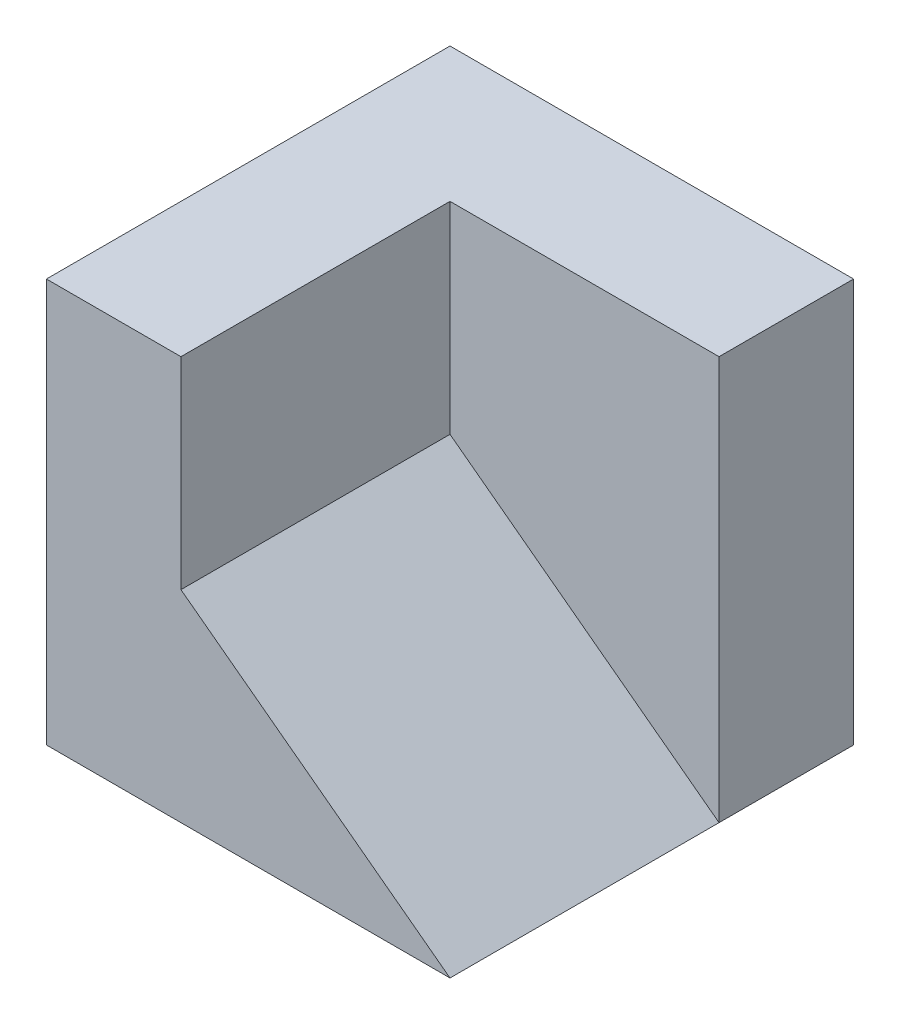
ISO-10303-21;
HEADER;
FILE_DESCRIPTION(('STEP AP214'),'2;1');
FILE_NAME('part.step','',(''),(''),'','','');
FILE_SCHEMA(('AUTOMOTIVE_DESIGN { 1 0 10303 214 1 1 1 1 }'));
ENDSEC;
DATA;
#1=APPLICATION_CONTEXT('core data for automotive mechanical design processes');
#2=APPLICATION_PROTOCOL_DEFINITION('international standard','automotive_design',2000,#1);
#3=PRODUCT_CONTEXT('',#1,'mechanical');
#4=PRODUCT('Part','Part','',(#3));
#5=PRODUCT_RELATED_PRODUCT_CATEGORY('part','',(#4));
#6=PRODUCT_DEFINITION_FORMATION('','',#4);
#7=PRODUCT_DEFINITION_CONTEXT('part definition',#1,'design');
#8=PRODUCT_DEFINITION('design','',#6,#7);
#9=PRODUCT_DEFINITION_SHAPE('','',#8);
#10=(LENGTH_UNIT() NAMED_UNIT(*) SI_UNIT(.MILLI.,.METRE.));
#11=(NAMED_UNIT(*) PLANE_ANGLE_UNIT() SI_UNIT($,.RADIAN.));
#12=(NAMED_UNIT(*) SI_UNIT($,.STERADIAN.) SOLID_ANGLE_UNIT());
#13=UNCERTAINTY_MEASURE_WITH_UNIT(LENGTH_MEASURE(1.E-05),#10,'distance_accuracy_value','');
#14=(GEOMETRIC_REPRESENTATION_CONTEXT(3) GLOBAL_UNCERTAINTY_ASSIGNED_CONTEXT((#13)) GLOBAL_UNIT_ASSIGNED_CONTEXT((#10,
#11,#12)) REPRESENTATION_CONTEXT('',''));
#15=CARTESIAN_POINT('',(0.,0.,0.));
#16=DIRECTION('',(0.,0.,1.));
#17=DIRECTION('',(1.,0.,0.));
#18=AXIS2_PLACEMENT_3D('',#15,#16,#17);
#19=CARTESIAN_POINT('',(60.,60.,0.));
#20=DIRECTION('',(-1.,0.,0.));
#21=DIRECTION('',(0.,0.,1.));
#22=AXIS2_PLACEMENT_3D('',#19,#20,#21);
#23=PLANE('',#22);
#24=DIRECTION('',(0.,1.,0.));
#25=VECTOR('',#24,1.);
#26=CARTESIAN_POINT('',(60.,60.,-40.));
#27=LINE('',#26,#25);
#28=CARTESIAN_POINT('',(60.,0.,-40.));
#29=VERTEX_POINT('',#28);
#30=CARTESIAN_POINT('',(60.,60.,-40.));
#31=VERTEX_POINT('',#30);
#32=EDGE_CURVE('E99',#29,#31,#27,.T.);
#33=ORIENTED_EDGE('',*,*,#32,.F.);
#34=DIRECTION('',(0.,0.,-1.));
#35=VECTOR('',#34,1.);
#36=CARTESIAN_POINT('',(60.,0.,0.));
#37=LINE('',#36,#35);
#38=CARTESIAN_POINT('',(60.,0.,-60.));
#39=VERTEX_POINT('',#38);
#40=EDGE_CURVE('E75',#29,#39,#37,.T.);
#41=ORIENTED_EDGE('',*,*,#40,.T.);
#42=DIRECTION('',(0.,-1.,0.));
#43=VECTOR('',#42,1.);
#44=CARTESIAN_POINT('',(60.,60.,-60.));
#45=LINE('',#44,#43);
#46=CARTESIAN_POINT('',(60.,60.,-60.));
#47=VERTEX_POINT('',#46);
#48=EDGE_CURVE('E112',#47,#39,#45,.T.);
#49=ORIENTED_EDGE('',*,*,#48,.F.);
#50=DIRECTION('',(0.,0.,-1.));
#51=VECTOR('',#50,1.);
#52=CARTESIAN_POINT('',(60.,60.,0.));
#53=LINE('',#52,#51);
#54=EDGE_CURVE('E50',#31,#47,#53,.T.);
#55=ORIENTED_EDGE('',*,*,#54,.F.);
#56=EDGE_LOOP('',(#33,#41,#49,#55));
#57=FACE_BOUND('',#56,.T.);
#58=ADVANCED_FACE('F33',(#57),#23,.F.);
#59=CARTESIAN_POINT('',(60.,60.,-60.));
#60=DIRECTION('',(0.,0.,1.));
#61=DIRECTION('',(1.,0.,0.));
#62=AXIS2_PLACEMENT_3D('',#59,#60,#61);
#63=PLANE('',#62);
#64=DIRECTION('',(-1.,0.,0.));
#65=VECTOR('',#64,1.);
#66=CARTESIAN_POINT('',(60.,0.,-60.));
#67=LINE('',#66,#65);
#68=CARTESIAN_POINT('',(0.,0.,-60.));
#69=VERTEX_POINT('',#68);
#70=EDGE_CURVE('E120',#39,#69,#67,.T.);
#71=ORIENTED_EDGE('',*,*,#70,.T.);
#72=DIRECTION('',(0.,-1.,0.));
#73=VECTOR('',#72,1.);
#74=CARTESIAN_POINT('',(0.,60.,-60.));
#75=LINE('',#74,#73);
#76=CARTESIAN_POINT('',(0.,60.,-60.));
#77=VERTEX_POINT('',#76);
#78=EDGE_CURVE('E11',#77,#69,#75,.T.);
#79=ORIENTED_EDGE('',*,*,#78,.F.);
#80=DIRECTION('',(-1.,0.,0.));
#81=VECTOR('',#80,1.);
#82=CARTESIAN_POINT('',(60.,60.,-60.));
#83=LINE('',#82,#81);
#84=EDGE_CURVE('E129',#47,#77,#83,.T.);
#85=ORIENTED_EDGE('',*,*,#84,.F.);
#86=ORIENTED_EDGE('',*,*,#48,.T.);
#87=EDGE_LOOP('',(#71,#79,#85,#86));
#88=FACE_BOUND('',#87,.T.);
#89=ADVANCED_FACE('F35',(#88),#63,.F.);
#90=CARTESIAN_POINT('',(0.,60.,-60.));
#91=DIRECTION('',(1.,0.,0.));
#92=DIRECTION('',(0.,0.,-1.));
#93=AXIS2_PLACEMENT_3D('',#90,#91,#92);
#94=PLANE('',#93);
#95=DIRECTION('',(0.,0.,1.));
#96=VECTOR('',#95,1.);
#97=CARTESIAN_POINT('',(0.,0.,-60.));
#98=LINE('',#97,#96);
#99=CARTESIAN_POINT('',(0.,0.,0.));
#100=VERTEX_POINT('',#99);
#101=EDGE_CURVE('E123',#69,#100,#98,.T.);
#102=ORIENTED_EDGE('',*,*,#101,.T.);
#103=DIRECTION('',(0.,-1.,0.));
#104=VECTOR('',#103,1.);
#105=CARTESIAN_POINT('',(0.,60.,0.));
#106=LINE('',#105,#104);
#107=CARTESIAN_POINT('',(0.,60.,0.));
#108=VERTEX_POINT('',#107);
#109=EDGE_CURVE('E42',#108,#100,#106,.T.);
#110=ORIENTED_EDGE('',*,*,#109,.F.);
#111=DIRECTION('',(0.,0.,1.));
#112=VECTOR('',#111,1.);
#113=CARTESIAN_POINT('',(0.,60.,-60.));
#114=LINE('',#113,#112);
#115=EDGE_CURVE('E80',#77,#108,#114,.T.);
#116=ORIENTED_EDGE('',*,*,#115,.F.);
#117=ORIENTED_EDGE('',*,*,#78,.T.);
#118=EDGE_LOOP('',(#102,#110,#116,#117));
#119=FACE_BOUND('',#118,.T.);
#120=ADVANCED_FACE('F152',(#119),#94,.F.);
#121=CARTESIAN_POINT('',(0.,60.,0.));
#122=DIRECTION('',(0.,0.,-1.));
#123=DIRECTION('',(-1.,0.,0.));
#124=AXIS2_PLACEMENT_3D('',#121,#122,#123);
#125=PLANE('',#124);
#126=DIRECTION('',(1.,0.,0.));
#127=VECTOR('',#126,1.);
#128=CARTESIAN_POINT('',(0.,0.,0.));
#129=LINE('',#128,#127);
#130=CARTESIAN_POINT('',(60.,0.,0.));
#131=VERTEX_POINT('',#130);
#132=EDGE_CURVE('E126',#100,#131,#129,.T.);
#133=ORIENTED_EDGE('',*,*,#132,.T.);
#134=DIRECTION('',(0.8,-0.6,0.));
#135=VECTOR('',#134,1.);
#136=CARTESIAN_POINT('',(60.,0.,0.));
#137=LINE('',#136,#135);
#138=CARTESIAN_POINT('',(20.,30.,0.));
#139=VERTEX_POINT('',#138);
#140=EDGE_CURVE('E69',#139,#131,#137,.T.);
#141=ORIENTED_EDGE('',*,*,#140,.F.);
#142=DIRECTION('',(0.,-1.,0.));
#143=VECTOR('',#142,1.);
#144=CARTESIAN_POINT('',(20.,30.,0.));
#145=LINE('',#144,#143);
#146=CARTESIAN_POINT('',(20.,60.,0.));
#147=VERTEX_POINT('',#146);
#148=EDGE_CURVE('E146',#147,#139,#145,.T.);
#149=ORIENTED_EDGE('',*,*,#148,.F.);
#150=DIRECTION('',(1.,0.,0.));
#151=VECTOR('',#150,1.);
#152=CARTESIAN_POINT('',(0.,60.,0.));
#153=LINE('',#152,#151);
#154=EDGE_CURVE('E114',#108,#147,#153,.T.);
#155=ORIENTED_EDGE('',*,*,#154,.F.);
#156=ORIENTED_EDGE('',*,*,#109,.T.);
#157=EDGE_LOOP('',(#133,#141,#149,#155,#156));
#158=FACE_BOUND('',#157,.T.);
#159=ADVANCED_FACE('F134',(#158),#125,.F.);
#160=CARTESIAN_POINT('',(0.,60.,0.));
#161=DIRECTION('',(0.,1.,0.));
#162=DIRECTION('',(0.,0.,1.));
#163=AXIS2_PLACEMENT_3D('',#160,#161,#162);
#164=PLANE('',#163);
#165=DIRECTION('',(0.,0.,1.));
#166=VECTOR('',#165,1.);
#167=CARTESIAN_POINT('',(20.,60.,-40.));
#168=LINE('',#167,#166);
#169=CARTESIAN_POINT('',(20.,60.,-40.));
#170=VERTEX_POINT('',#169);
#171=EDGE_CURVE('E109',#170,#147,#168,.T.);
#172=ORIENTED_EDGE('',*,*,#171,.F.);
#173=DIRECTION('',(-1.,0.,0.));
#174=VECTOR('',#173,1.);
#175=CARTESIAN_POINT('',(20.,60.,-40.));
#176=LINE('',#175,#174);
#177=EDGE_CURVE('E102',#31,#170,#176,.T.);
#178=ORIENTED_EDGE('',*,*,#177,.F.);
#179=ORIENTED_EDGE('',*,*,#54,.T.);
#180=ORIENTED_EDGE('',*,*,#84,.T.);
#181=ORIENTED_EDGE('',*,*,#115,.T.);
#182=ORIENTED_EDGE('',*,*,#154,.T.);
#183=EDGE_LOOP('',(#172,#178,#179,#180,#181,#182));
#184=FACE_BOUND('',#183,.T.);
#185=ADVANCED_FACE('F107',(#184),#164,.T.);
#186=CARTESIAN_POINT('',(0.,0.,0.));
#187=DIRECTION('',(0.,1.,0.));
#188=DIRECTION('',(0.,0.,1.));
#189=AXIS2_PLACEMENT_3D('',#186,#187,#188);
#190=PLANE('',#189);
#191=ORIENTED_EDGE('',*,*,#70,.F.);
#192=ORIENTED_EDGE('',*,*,#40,.F.);
#193=EDGE_CURVE('E128',#131,#29,#37,.T.);
#194=ORIENTED_EDGE('',*,*,#193,.F.);
#195=ORIENTED_EDGE('',*,*,#132,.F.);
#196=ORIENTED_EDGE('',*,*,#101,.F.);
#197=EDGE_LOOP('',(#191,#192,#194,#195,#196));
#198=FACE_BOUND('',#197,.T.);
#199=ADVANCED_FACE('F139',(#198),#190,.F.);
#200=CARTESIAN_POINT('',(60.,0.,-40.));
#201=DIRECTION('',(-0.6,-0.8,0.));
#202=DIRECTION('',(0.8,-0.6,0.));
#203=AXIS2_PLACEMENT_3D('',#200,#201,#202);
#204=PLANE('',#203);
#205=ORIENTED_EDGE('',*,*,#140,.T.);
#206=ORIENTED_EDGE('',*,*,#193,.T.);
#207=DIRECTION('',(0.8,-0.6,0.));
#208=VECTOR('',#207,1.);
#209=CARTESIAN_POINT('',(60.,0.,-40.));
#210=LINE('',#209,#208);
#211=CARTESIAN_POINT('',(20.,30.,-40.));
#212=VERTEX_POINT('',#211);
#213=EDGE_CURVE('E105',#212,#29,#210,.T.);
#214=ORIENTED_EDGE('',*,*,#213,.F.);
#215=DIRECTION('',(0.,0.,1.));
#216=VECTOR('',#215,1.);
#217=CARTESIAN_POINT('',(20.,30.,-40.));
#218=LINE('',#217,#216);
#219=EDGE_CURVE('E124',#212,#139,#218,.T.);
#220=ORIENTED_EDGE('',*,*,#219,.T.);
#221=EDGE_LOOP('',(#205,#206,#214,#220));
#222=FACE_BOUND('',#221,.T.);
#223=ADVANCED_FACE('F140',(#222),#204,.F.);
#224=CARTESIAN_POINT('',(20.,30.,-40.));
#225=DIRECTION('',(-1.,0.,0.));
#226=DIRECTION('',(0.,0.,1.));
#227=AXIS2_PLACEMENT_3D('',#224,#225,#226);
#228=PLANE('',#227);
#229=ORIENTED_EDGE('',*,*,#148,.T.);
#230=ORIENTED_EDGE('',*,*,#219,.F.);
#231=DIRECTION('',(0.,-1.,0.));
#232=VECTOR('',#231,1.);
#233=CARTESIAN_POINT('',(20.,30.,-40.));
#234=LINE('',#233,#232);
#235=EDGE_CURVE('E110',#170,#212,#234,.T.);
#236=ORIENTED_EDGE('',*,*,#235,.F.);
#237=ORIENTED_EDGE('',*,*,#171,.T.);
#238=EDGE_LOOP('',(#229,#230,#236,#237));
#239=FACE_BOUND('',#238,.T.);
#240=ADVANCED_FACE('F168',(#239),#228,.F.);
#241=CARTESIAN_POINT('',(0.,0.,-40.));
#242=DIRECTION('',(0.,0.,1.));
#243=DIRECTION('',(1.,0.,0.));
#244=AXIS2_PLACEMENT_3D('',#241,#242,#243);
#245=PLANE('',#244);
#246=ORIENTED_EDGE('',*,*,#32,.T.);
#247=ORIENTED_EDGE('',*,*,#177,.T.);
#248=ORIENTED_EDGE('',*,*,#235,.T.);
#249=ORIENTED_EDGE('',*,*,#213,.T.);
#250=EDGE_LOOP('',(#246,#247,#248,#249));
#251=FACE_BOUND('',#250,.T.);
#252=ADVANCED_FACE('F100',(#251),#245,.T.);
#253=CLOSED_SHELL('',(#58,#89,#120,#159,#185,#199,#223,#240,#252));
#254=MANIFOLD_SOLID_BREP('B2',#253);
#255=ADVANCED_BREP_SHAPE_REPRESENTATION('',(#18,#254),#14);
#256=SHAPE_DEFINITION_REPRESENTATION(#9,#255);
ENDSEC;
END-ISO-10303-21;
